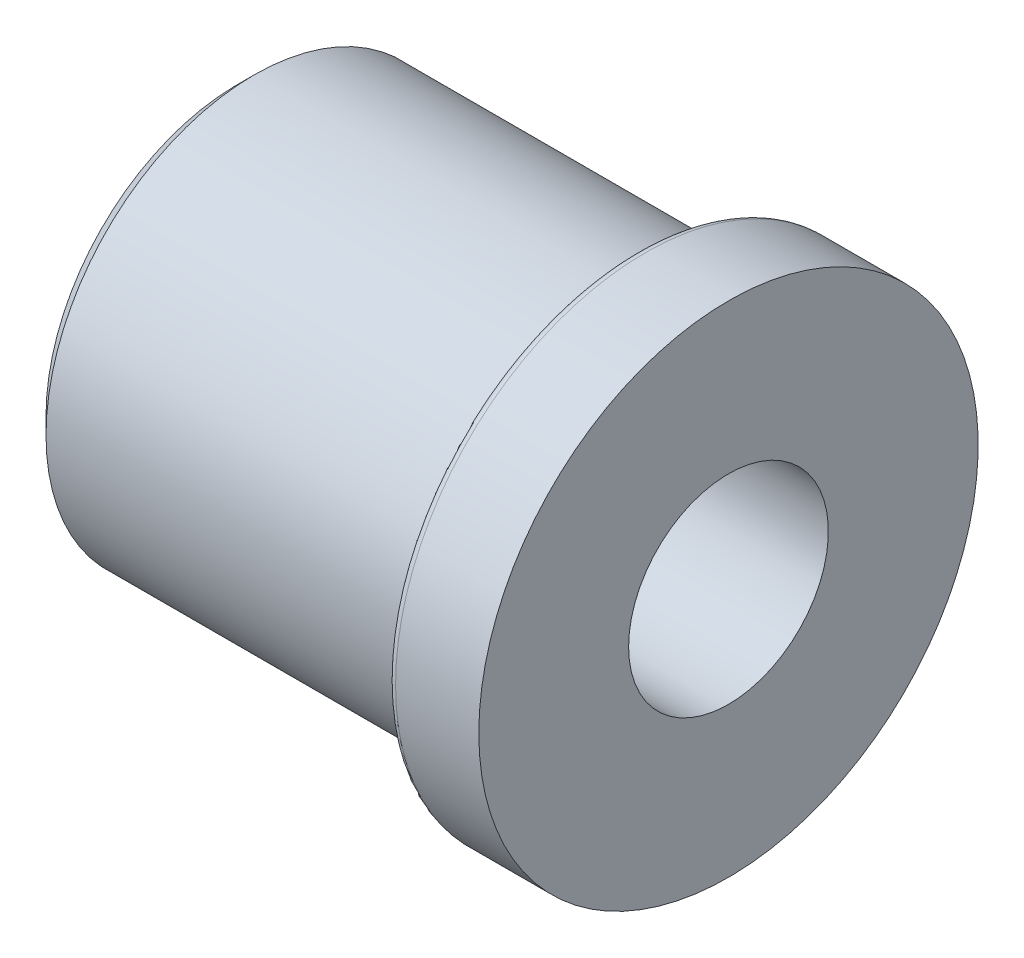
ISO-10303-21;
HEADER;
FILE_DESCRIPTION(('STEP AP214'),'2;1');
FILE_NAME('part.step','',(''),(''),'','','');
FILE_SCHEMA(('AUTOMOTIVE_DESIGN { 1 0 10303 214 1 1 1 1 }'));
ENDSEC;
DATA;
#1=APPLICATION_CONTEXT('core data for automotive mechanical design processes');
#2=APPLICATION_PROTOCOL_DEFINITION('international standard','automotive_design',2000,#1);
#3=PRODUCT_CONTEXT('',#1,'mechanical');
#4=PRODUCT('Part','Part','',(#3));
#5=PRODUCT_RELATED_PRODUCT_CATEGORY('part','',(#4));
#6=PRODUCT_DEFINITION_FORMATION('','',#4);
#7=PRODUCT_DEFINITION_CONTEXT('part definition',#1,'design');
#8=PRODUCT_DEFINITION('design','',#6,#7);
#9=PRODUCT_DEFINITION_SHAPE('','',#8);
#10=(LENGTH_UNIT() NAMED_UNIT(*) SI_UNIT(.MILLI.,.METRE.));
#11=(NAMED_UNIT(*) PLANE_ANGLE_UNIT() SI_UNIT($,.RADIAN.));
#12=(NAMED_UNIT(*) SI_UNIT($,.STERADIAN.) SOLID_ANGLE_UNIT());
#13=UNCERTAINTY_MEASURE_WITH_UNIT(LENGTH_MEASURE(1.E-05),#10,'distance_accuracy_value','');
#14=(GEOMETRIC_REPRESENTATION_CONTEXT(3) GLOBAL_UNCERTAINTY_ASSIGNED_CONTEXT((#13)) GLOBAL_UNIT_ASSIGNED_CONTEXT((#10,
#11,#12)) REPRESENTATION_CONTEXT('',''));
#15=CARTESIAN_POINT('',(0.,0.,0.));
#16=DIRECTION('',(0.,0.,1.));
#17=DIRECTION('',(1.,0.,0.));
#18=AXIS2_PLACEMENT_3D('',#15,#16,#17);
#19=CARTESIAN_POINT('',(0.,0.,0.));
#20=DIRECTION('',(-1.,0.,0.));
#21=DIRECTION('',(0.,0.,1.));
#22=AXIS2_PLACEMENT_3D('',#19,#20,#21);
#23=CYLINDRICAL_SURFACE('',#22,15.);
#24=CARTESIAN_POINT('',(24.5,0.,0.));
#25=DIRECTION('',(-1.,0.,0.));
#26=DIRECTION('',(0.,0.,1.));
#27=AXIS2_PLACEMENT_3D('',#24,#25,#26);
#28=CIRCLE('',#27,15.);
#29=CARTESIAN_POINT('',(24.5,0.,15.));
#30=VERTEX_POINT('',#29);
#31=EDGE_CURVE('E10',#30,#30,#28,.T.);
#32=ORIENTED_EDGE('',*,*,#31,.F.);
#33=EDGE_LOOP('',(#32));
#34=FACE_BOUND('',#33,.T.);
#35=CARTESIAN_POINT('',(29.5,0.,0.));
#36=DIRECTION('',(-1.,0.,0.));
#37=DIRECTION('',(0.,0.,1.));
#38=AXIS2_PLACEMENT_3D('',#35,#36,#37);
#39=CIRCLE('',#38,15.);
#40=CARTESIAN_POINT('',(29.5,0.,15.));
#41=VERTEX_POINT('',#40);
#42=EDGE_CURVE('E61',#41,#41,#39,.T.);
#43=ORIENTED_EDGE('',*,*,#42,.T.);
#44=EDGE_LOOP('',(#43));
#45=FACE_BOUND('',#44,.T.);
#46=ADVANCED_FACE('F33',(#34,#45),#23,.T.);
#47=CARTESIAN_POINT('',(24.5,0.,0.));
#48=DIRECTION('',(-1.,0.,0.));
#49=DIRECTION('',(0.,0.,1.));
#50=AXIS2_PLACEMENT_3D('',#47,#48,#49);
#51=TOROIDAL_SURFACE('',#50,14.5,0.5);
#52=CARTESIAN_POINT('',(24.,0.,0.));
#53=DIRECTION('',(-1.,0.,0.));
#54=DIRECTION('',(0.,0.,1.));
#55=AXIS2_PLACEMENT_3D('',#52,#53,#54);
#56=CIRCLE('',#55,14.5);
#57=CARTESIAN_POINT('',(24.,0.,14.5));
#58=VERTEX_POINT('',#57);
#59=EDGE_CURVE('E39',#58,#58,#56,.T.);
#60=ORIENTED_EDGE('',*,*,#59,.F.);
#61=EDGE_LOOP('',(#60));
#62=FACE_BOUND('',#61,.T.);
#63=ORIENTED_EDGE('',*,*,#31,.T.);
#64=EDGE_LOOP('',(#63));
#65=FACE_BOUND('',#64,.T.);
#66=ADVANCED_FACE('F98',(#62,#65),#51,.T.);
#67=CARTESIAN_POINT('',(24.,14.5,0.));
#68=DIRECTION('',(1.,0.,0.));
#69=DIRECTION('',(0.,0.,-1.));
#70=AXIS2_PLACEMENT_3D('',#67,#68,#69);
#71=PLANE('',#70);
#72=CARTESIAN_POINT('',(24.,0.,0.));
#73=DIRECTION('',(-1.,0.,0.));
#74=DIRECTION('',(0.,0.,1.));
#75=AXIS2_PLACEMENT_3D('',#72,#73,#74);
#76=CIRCLE('',#75,12.5);
#77=CARTESIAN_POINT('',(24.,0.,12.5));
#78=VERTEX_POINT('',#77);
#79=EDGE_CURVE('E43',#78,#78,#76,.T.);
#80=ORIENTED_EDGE('',*,*,#79,.F.);
#81=EDGE_LOOP('',(#80));
#82=FACE_BOUND('',#81,.T.);
#83=ORIENTED_EDGE('',*,*,#59,.T.);
#84=EDGE_LOOP('',(#83));
#85=FACE_BOUND('',#84,.T.);
#86=ADVANCED_FACE('F93',(#82,#85),#71,.F.);
#87=CARTESIAN_POINT('',(0.,0.,0.));
#88=DIRECTION('',(-1.,0.,0.));
#89=DIRECTION('',(0.,0.,1.));
#90=AXIS2_PLACEMENT_3D('',#87,#88,#89);
#91=CYLINDRICAL_SURFACE('',#90,12.5);
#92=CARTESIAN_POINT('',(1.,0.,0.));
#93=DIRECTION('',(-1.,0.,0.));
#94=DIRECTION('',(0.,0.,1.));
#95=AXIS2_PLACEMENT_3D('',#92,#93,#94);
#96=CIRCLE('',#95,12.5);
#97=CARTESIAN_POINT('',(1.,0.,12.5));
#98=VERTEX_POINT('',#97);
#99=EDGE_CURVE('E47',#98,#98,#96,.T.);
#100=ORIENTED_EDGE('',*,*,#99,.F.);
#101=EDGE_LOOP('',(#100));
#102=FACE_BOUND('',#101,.T.);
#103=ORIENTED_EDGE('',*,*,#79,.T.);
#104=EDGE_LOOP('',(#103));
#105=FACE_BOUND('',#104,.T.);
#106=ADVANCED_FACE('F87',(#102,#105),#91,.T.);
#107=CARTESIAN_POINT('',(1.,0.,0.));
#108=DIRECTION('',(1.,0.,0.));
#109=DIRECTION('',(0.,0.,-1.));
#110=AXIS2_PLACEMENT_3D('',#107,#108,#109);
#111=CONICAL_SURFACE('',#110,12.5,0.78539816339745);
#112=CARTESIAN_POINT('',(0.,0.,0.));
#113=DIRECTION('',(-1.,0.,0.));
#114=DIRECTION('',(0.,0.,1.));
#115=AXIS2_PLACEMENT_3D('',#112,#113,#114);
#116=CIRCLE('',#115,11.5);
#117=CARTESIAN_POINT('',(0.,0.,11.5));
#118=VERTEX_POINT('',#117);
#119=EDGE_CURVE('E52',#118,#118,#116,.T.);
#120=ORIENTED_EDGE('',*,*,#119,.F.);
#121=EDGE_LOOP('',(#120));
#122=FACE_BOUND('',#121,.T.);
#123=ORIENTED_EDGE('',*,*,#99,.T.);
#124=EDGE_LOOP('',(#123));
#125=FACE_BOUND('',#124,.T.);
#126=ADVANCED_FACE('F81',(#122,#125),#111,.T.);
#127=CARTESIAN_POINT('',(0.,6.,0.));
#128=DIRECTION('',(1.,0.,0.));
#129=DIRECTION('',(0.,0.,-1.));
#130=AXIS2_PLACEMENT_3D('',#127,#128,#129);
#131=PLANE('',#130);
#132=CARTESIAN_POINT('',(0.,0.,0.));
#133=DIRECTION('',(-1.,0.,0.));
#134=DIRECTION('',(0.,0.,1.));
#135=AXIS2_PLACEMENT_3D('',#132,#133,#134);
#136=CIRCLE('',#135,6.);
#137=CARTESIAN_POINT('',(0.,0.,6.));
#138=VERTEX_POINT('',#137);
#139=EDGE_CURVE('E55',#138,#138,#136,.T.);
#140=ORIENTED_EDGE('',*,*,#139,.F.);
#141=EDGE_LOOP('',(#140));
#142=FACE_BOUND('',#141,.T.);
#143=ORIENTED_EDGE('',*,*,#119,.T.);
#144=EDGE_LOOP('',(#143));
#145=FACE_BOUND('',#144,.T.);
#146=ADVANCED_FACE('F75',(#142,#145),#131,.F.);
#147=CARTESIAN_POINT('',(0.,0.,0.));
#148=DIRECTION('',(-1.,0.,0.));
#149=DIRECTION('',(0.,0.,1.));
#150=AXIS2_PLACEMENT_3D('',#147,#148,#149);
#151=CYLINDRICAL_SURFACE('',#150,6.);
#152=CARTESIAN_POINT('',(29.5,0.,0.));
#153=DIRECTION('',(-1.,0.,0.));
#154=DIRECTION('',(0.,0.,1.));
#155=AXIS2_PLACEMENT_3D('',#152,#153,#154);
#156=CIRCLE('',#155,6.);
#157=CARTESIAN_POINT('',(29.5,0.,6.));
#158=VERTEX_POINT('',#157);
#159=EDGE_CURVE('E58',#158,#158,#156,.T.);
#160=ORIENTED_EDGE('',*,*,#159,.F.);
#161=EDGE_LOOP('',(#160));
#162=FACE_BOUND('',#161,.T.);
#163=ORIENTED_EDGE('',*,*,#139,.T.);
#164=EDGE_LOOP('',(#163));
#165=FACE_BOUND('',#164,.T.);
#166=ADVANCED_FACE('F69',(#162,#165),#151,.F.);
#167=CARTESIAN_POINT('',(29.5,6.,0.));
#168=DIRECTION('',(-1.,0.,0.));
#169=DIRECTION('',(0.,0.,1.));
#170=AXIS2_PLACEMENT_3D('',#167,#168,#169);
#171=PLANE('',#170);
#172=ORIENTED_EDGE('',*,*,#42,.F.);
#173=EDGE_LOOP('',(#172));
#174=FACE_BOUND('',#173,.T.);
#175=ORIENTED_EDGE('',*,*,#159,.T.);
#176=EDGE_LOOP('',(#175));
#177=FACE_BOUND('',#176,.T.);
#178=ADVANCED_FACE('F66',(#174,#177),#171,.F.);
#179=CLOSED_SHELL('',(#46,#66,#86,#106,#126,#146,#166,#178));
#180=MANIFOLD_SOLID_BREP('B2',#179);
#181=ADVANCED_BREP_SHAPE_REPRESENTATION('',(#18,#180),#14);
#182=SHAPE_DEFINITION_REPRESENTATION(#9,#181);
ENDSEC;
END-ISO-10303-21;
